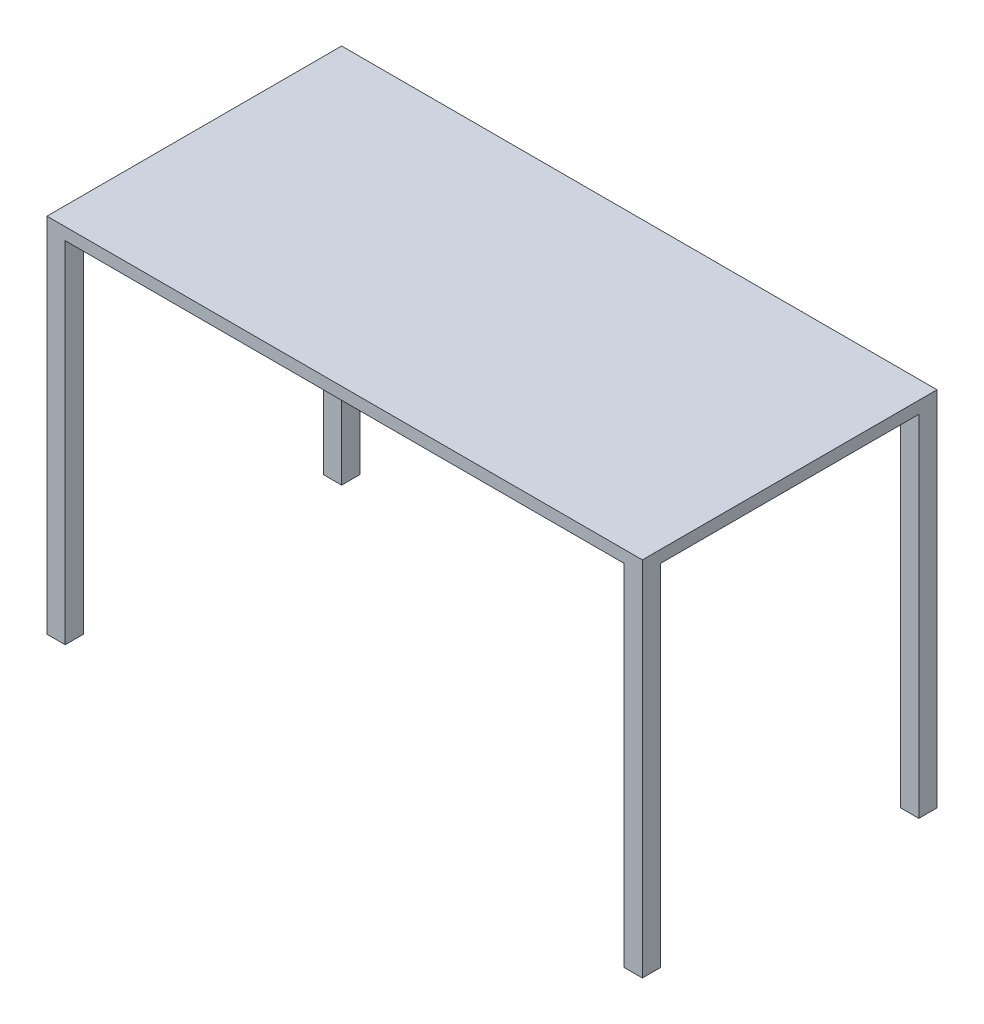
ISO-10303-21;
HEADER;
FILE_DESCRIPTION(('STEP AP214'),'2;1');
FILE_NAME('part.step','',(''),(''),'','','');
FILE_SCHEMA(('AUTOMOTIVE_DESIGN { 1 0 10303 214 1 1 1 1 }'));
ENDSEC;
DATA;
#1=APPLICATION_CONTEXT('core data for automotive mechanical design processes');
#2=APPLICATION_PROTOCOL_DEFINITION('international standard','automotive_design',2000,#1);
#3=PRODUCT_CONTEXT('',#1,'mechanical');
#4=PRODUCT('Part','Part','',(#3));
#5=PRODUCT_RELATED_PRODUCT_CATEGORY('part','',(#4));
#6=PRODUCT_DEFINITION_FORMATION('','',#4);
#7=PRODUCT_DEFINITION_CONTEXT('part definition',#1,'design');
#8=PRODUCT_DEFINITION('design','',#6,#7);
#9=PRODUCT_DEFINITION_SHAPE('','',#8);
#10=(LENGTH_UNIT() NAMED_UNIT(*) SI_UNIT(.MILLI.,.METRE.));
#11=(NAMED_UNIT(*) PLANE_ANGLE_UNIT() SI_UNIT($,.RADIAN.));
#12=(NAMED_UNIT(*) SI_UNIT($,.STERADIAN.) SOLID_ANGLE_UNIT());
#13=UNCERTAINTY_MEASURE_WITH_UNIT(LENGTH_MEASURE(1.E-05),#10,'distance_accuracy_value','');
#14=(GEOMETRIC_REPRESENTATION_CONTEXT(3) GLOBAL_UNCERTAINTY_ASSIGNED_CONTEXT((#13)) GLOBAL_UNIT_ASSIGNED_CONTEXT((#10,
#11,#12)) REPRESENTATION_CONTEXT('',''));
#15=CARTESIAN_POINT('',(0.,0.,0.));
#16=DIRECTION('',(0.,0.,1.));
#17=DIRECTION('',(1.,0.,0.));
#18=AXIS2_PLACEMENT_3D('',#15,#16,#17);
#19=CARTESIAN_POINT('',(0.,0.,0.));
#20=DIRECTION('',(0.,-1.,0.));
#21=DIRECTION('',(0.,0.,-1.));
#22=AXIS2_PLACEMENT_3D('',#19,#20,#21);
#23=PLANE('',#22);
#24=DIRECTION('',(-1.,0.,0.));
#25=VECTOR('',#24,1.);
#26=CARTESIAN_POINT('',(-622.3,0.,-269.875));
#27=LINE('',#26,#25);
#28=CARTESIAN_POINT('',(-584.2,0.,-269.875));
#29=VERTEX_POINT('',#28);
#30=CARTESIAN_POINT('',(-622.3,0.,-269.875));
#31=VERTEX_POINT('',#30);
#32=EDGE_CURVE('E170',#29,#31,#27,.T.);
#33=ORIENTED_EDGE('',*,*,#32,.F.);
#34=DIRECTION('',(0.,0.,1.));
#35=VECTOR('',#34,1.);
#36=CARTESIAN_POINT('',(-584.2,0.,-307.975));
#37=LINE('',#36,#35);
#38=CARTESIAN_POINT('',(-584.2,0.,-307.975));
#39=VERTEX_POINT('',#38);
#40=EDGE_CURVE('E304',#39,#29,#37,.T.);
#41=ORIENTED_EDGE('',*,*,#40,.F.);
#42=DIRECTION('',(-1.,0.,0.));
#43=VECTOR('',#42,1.);
#44=CARTESIAN_POINT('',(-622.3,0.,-307.975));
#45=LINE('',#44,#43);
#46=CARTESIAN_POINT('',(584.2,0.,-307.975));
#47=VERTEX_POINT('',#46);
#48=EDGE_CURVE('E174',#47,#39,#45,.T.);
#49=ORIENTED_EDGE('',*,*,#48,.F.);
#50=DIRECTION('',(0.,0.,-1.));
#51=VECTOR('',#50,1.);
#52=CARTESIAN_POINT('',(584.2,0.,-307.975));
#53=LINE('',#52,#51);
#54=CARTESIAN_POINT('',(584.2,0.,-269.875));
#55=VERTEX_POINT('',#54);
#56=EDGE_CURVE('E177',#55,#47,#53,.T.);
#57=ORIENTED_EDGE('',*,*,#56,.F.);
#58=DIRECTION('',(-1.,0.,0.));
#59=VECTOR('',#58,1.);
#60=CARTESIAN_POINT('',(622.3,0.,-269.875));
#61=LINE('',#60,#59);
#62=CARTESIAN_POINT('',(622.3,0.,-269.875));
#63=VERTEX_POINT('',#62);
#64=EDGE_CURVE('E175',#63,#55,#61,.T.);
#65=ORIENTED_EDGE('',*,*,#64,.F.);
#66=DIRECTION('',(0.,0.,-1.));
#67=VECTOR('',#66,1.);
#68=CARTESIAN_POINT('',(622.3,0.,307.975));
#69=LINE('',#68,#67);
#70=CARTESIAN_POINT('',(622.3,0.,269.875));
#71=VERTEX_POINT('',#70);
#72=EDGE_CURVE('E256',#71,#63,#69,.T.);
#73=ORIENTED_EDGE('',*,*,#72,.F.);
#74=DIRECTION('',(1.,0.,0.));
#75=VECTOR('',#74,1.);
#76=CARTESIAN_POINT('',(622.3,0.,269.875));
#77=LINE('',#76,#75);
#78=CARTESIAN_POINT('',(584.2,0.,269.875));
#79=VERTEX_POINT('',#78);
#80=EDGE_CURVE('E204',#79,#71,#77,.T.);
#81=ORIENTED_EDGE('',*,*,#80,.F.);
#82=DIRECTION('',(0.,0.,-1.));
#83=VECTOR('',#82,1.);
#84=CARTESIAN_POINT('',(584.2,0.,307.975));
#85=LINE('',#84,#83);
#86=CARTESIAN_POINT('',(584.2,0.,307.975));
#87=VERTEX_POINT('',#86);
#88=EDGE_CURVE('E199',#87,#79,#85,.T.);
#89=ORIENTED_EDGE('',*,*,#88,.F.);
#90=DIRECTION('',(1.,0.,0.));
#91=VECTOR('',#90,1.);
#92=CARTESIAN_POINT('',(-622.3,0.,307.975));
#93=LINE('',#92,#91);
#94=CARTESIAN_POINT('',(-584.2,0.,307.975));
#95=VERTEX_POINT('',#94);
#96=EDGE_CURVE('E266',#95,#87,#93,.T.);
#97=ORIENTED_EDGE('',*,*,#96,.F.);
#98=DIRECTION('',(0.,0.,1.));
#99=VECTOR('',#98,1.);
#100=CARTESIAN_POINT('',(-584.2,0.,307.975));
#101=LINE('',#100,#99);
#102=CARTESIAN_POINT('',(-584.2,0.,269.875));
#103=VERTEX_POINT('',#102);
#104=EDGE_CURVE('E226',#103,#95,#101,.T.);
#105=ORIENTED_EDGE('',*,*,#104,.F.);
#106=DIRECTION('',(1.,0.,0.));
#107=VECTOR('',#106,1.);
#108=CARTESIAN_POINT('',(-622.3,0.,269.875));
#109=LINE('',#108,#107);
#110=CARTESIAN_POINT('',(-622.3,0.,269.875));
#111=VERTEX_POINT('',#110);
#112=EDGE_CURVE('E221',#111,#103,#109,.T.);
#113=ORIENTED_EDGE('',*,*,#112,.F.);
#114=DIRECTION('',(0.,0.,1.));
#115=VECTOR('',#114,1.);
#116=CARTESIAN_POINT('',(-622.3,0.,307.975));
#117=LINE('',#116,#115);
#118=EDGE_CURVE('E39',#31,#111,#117,.T.);
#119=ORIENTED_EDGE('',*,*,#118,.F.);
#120=EDGE_LOOP('',(#33,#41,#49,#57,#65,#73,#81,#89,#97,#105,#113,#119));
#121=FACE_BOUND('',#120,.T.);
#122=ADVANCED_FACE('F35',(#121),#23,.T.);
#123=CARTESIAN_POINT('',(622.3,25.4,307.975));
#124=DIRECTION('',(-1.,0.,0.));
#125=DIRECTION('',(0.,0.,1.));
#126=AXIS2_PLACEMENT_3D('',#123,#124,#125);
#127=PLANE('',#126);
#128=DIRECTION('',(0.,-1.,0.));
#129=VECTOR('',#128,1.);
#130=CARTESIAN_POINT('',(622.3,25.4,307.975));
#131=LINE('',#130,#129);
#132=CARTESIAN_POINT('',(622.3,25.4,307.975));
#133=VERTEX_POINT('',#132);
#134=CARTESIAN_POINT('',(622.3,-731.52,307.975));
#135=VERTEX_POINT('',#134);
#136=EDGE_CURVE('E274',#133,#135,#131,.T.);
#137=ORIENTED_EDGE('',*,*,#136,.T.);
#138=DIRECTION('',(0.,0.,1.));
#139=VECTOR('',#138,1.);
#140=CARTESIAN_POINT('',(622.3,-731.52,307.975));
#141=LINE('',#140,#139);
#142=CARTESIAN_POINT('',(622.3,-731.52,269.875));
#143=VERTEX_POINT('',#142);
#144=EDGE_CURVE('E208',#143,#135,#141,.T.);
#145=ORIENTED_EDGE('',*,*,#144,.F.);
#146=DIRECTION('',(0.,1.,0.));
#147=VECTOR('',#146,1.);
#148=CARTESIAN_POINT('',(622.3,-731.52,269.875));
#149=LINE('',#148,#147);
#150=EDGE_CURVE('E211',#143,#71,#149,.T.);
#151=ORIENTED_EDGE('',*,*,#150,.T.);
#152=ORIENTED_EDGE('',*,*,#72,.T.);
#153=DIRECTION('',(0.,1.,0.));
#154=VECTOR('',#153,1.);
#155=CARTESIAN_POINT('',(622.3,-731.52,-269.875));
#156=LINE('',#155,#154);
#157=CARTESIAN_POINT('',(622.3,-731.52,-269.875));
#158=VERTEX_POINT('',#157);
#159=EDGE_CURVE('E197',#158,#63,#156,.T.);
#160=ORIENTED_EDGE('',*,*,#159,.F.);
#161=DIRECTION('',(0.,0.,1.));
#162=VECTOR('',#161,1.);
#163=CARTESIAN_POINT('',(622.3,-731.52,-307.975));
#164=LINE('',#163,#162);
#165=CARTESIAN_POINT('',(622.3,-731.52,-307.975));
#166=VERTEX_POINT('',#165);
#167=EDGE_CURVE('E182',#166,#158,#164,.T.);
#168=ORIENTED_EDGE('',*,*,#167,.F.);
#169=DIRECTION('',(0.,-1.,0.));
#170=VECTOR('',#169,1.);
#171=CARTESIAN_POINT('',(622.3,25.4,-307.975));
#172=LINE('',#171,#170);
#173=CARTESIAN_POINT('',(622.3,25.4,-307.975));
#174=VERTEX_POINT('',#173);
#175=EDGE_CURVE('E11',#174,#166,#172,.T.);
#176=ORIENTED_EDGE('',*,*,#175,.F.);
#177=DIRECTION('',(0.,0.,-1.));
#178=VECTOR('',#177,1.);
#179=CARTESIAN_POINT('',(622.3,25.4,307.975));
#180=LINE('',#179,#178);
#181=EDGE_CURVE('E268',#133,#174,#180,.T.);
#182=ORIENTED_EDGE('',*,*,#181,.F.);
#183=EDGE_LOOP('',(#137,#145,#151,#152,#160,#168,#176,#182));
#184=FACE_BOUND('',#183,.T.);
#185=ADVANCED_FACE('F37',(#184),#127,.F.);
#186=CARTESIAN_POINT('',(-622.3,25.4,-307.975));
#187=DIRECTION('',(0.,0.,1.));
#188=DIRECTION('',(1.,0.,0.));
#189=AXIS2_PLACEMENT_3D('',#186,#187,#188);
#190=PLANE('',#189);
#191=ORIENTED_EDGE('',*,*,#175,.T.);
#192=DIRECTION('',(1.,0.,0.));
#193=VECTOR('',#192,1.);
#194=CARTESIAN_POINT('',(622.3,-731.52,-307.975));
#195=LINE('',#194,#193);
#196=CARTESIAN_POINT('',(584.2,-731.52,-307.975));
#197=VERTEX_POINT('',#196);
#198=EDGE_CURVE('E189',#197,#166,#195,.T.);
#199=ORIENTED_EDGE('',*,*,#198,.F.);
#200=DIRECTION('',(0.,1.,0.));
#201=VECTOR('',#200,1.);
#202=CARTESIAN_POINT('',(584.2,-731.52,-307.975));
#203=LINE('',#202,#201);
#204=EDGE_CURVE('E61',#197,#47,#203,.T.);
#205=ORIENTED_EDGE('',*,*,#204,.T.);
#206=ORIENTED_EDGE('',*,*,#48,.T.);
#207=DIRECTION('',(0.,1.,0.));
#208=VECTOR('',#207,1.);
#209=CARTESIAN_POINT('',(-584.2,-731.52,-307.975));
#210=LINE('',#209,#208);
#211=CARTESIAN_POINT('',(-584.2,-731.52,-307.975));
#212=VERTEX_POINT('',#211);
#213=EDGE_CURVE('E156',#212,#39,#210,.T.);
#214=ORIENTED_EDGE('',*,*,#213,.F.);
#215=DIRECTION('',(1.,0.,0.));
#216=VECTOR('',#215,1.);
#217=CARTESIAN_POINT('',(-622.3,-731.52,-307.975));
#218=LINE('',#217,#216);
#219=CARTESIAN_POINT('',(-622.3,-731.52,-307.975));
#220=VERTEX_POINT('',#219);
#221=EDGE_CURVE('E163',#220,#212,#218,.T.);
#222=ORIENTED_EDGE('',*,*,#221,.F.);
#223=DIRECTION('',(0.,-1.,0.));
#224=VECTOR('',#223,1.);
#225=CARTESIAN_POINT('',(-622.3,25.4,-307.975));
#226=LINE('',#225,#224);
#227=CARTESIAN_POINT('',(-622.3,25.4,-307.975));
#228=VERTEX_POINT('',#227);
#229=EDGE_CURVE('E45',#228,#220,#226,.T.);
#230=ORIENTED_EDGE('',*,*,#229,.F.);
#231=DIRECTION('',(-1.,0.,0.));
#232=VECTOR('',#231,1.);
#233=CARTESIAN_POINT('',(-622.3,25.4,-307.975));
#234=LINE('',#233,#232);
#235=EDGE_CURVE('E282',#174,#228,#234,.T.);
#236=ORIENTED_EDGE('',*,*,#235,.F.);
#237=EDGE_LOOP('',(#191,#199,#205,#206,#214,#222,#230,#236));
#238=FACE_BOUND('',#237,.T.);
#239=ADVANCED_FACE('F172',(#238),#190,.F.);
#240=CARTESIAN_POINT('',(-622.3,25.4,307.975));
#241=DIRECTION('',(1.,0.,0.));
#242=DIRECTION('',(0.,0.,-1.));
#243=AXIS2_PLACEMENT_3D('',#240,#241,#242);
#244=PLANE('',#243);
#245=ORIENTED_EDGE('',*,*,#229,.T.);
#246=DIRECTION('',(0.,0.,-1.));
#247=VECTOR('',#246,1.);
#248=CARTESIAN_POINT('',(-622.3,-731.52,-307.975));
#249=LINE('',#248,#247);
#250=CARTESIAN_POINT('',(-622.3,-731.52,-269.875));
#251=VERTEX_POINT('',#250);
#252=EDGE_CURVE('E168',#251,#220,#249,.T.);
#253=ORIENTED_EDGE('',*,*,#252,.F.);
#254=DIRECTION('',(0.,1.,0.));
#255=VECTOR('',#254,1.);
#256=CARTESIAN_POINT('',(-622.3,-731.52,-269.875));
#257=LINE('',#256,#255);
#258=EDGE_CURVE('E53',#251,#31,#257,.T.);
#259=ORIENTED_EDGE('',*,*,#258,.T.);
#260=ORIENTED_EDGE('',*,*,#118,.T.);
#261=DIRECTION('',(0.,1.,0.));
#262=VECTOR('',#261,1.);
#263=CARTESIAN_POINT('',(-622.3,-731.52,269.875));
#264=LINE('',#263,#262);
#265=CARTESIAN_POINT('',(-622.3,-731.52,269.875));
#266=VERTEX_POINT('',#265);
#267=EDGE_CURVE('E251',#266,#111,#264,.T.);
#268=ORIENTED_EDGE('',*,*,#267,.F.);
#269=DIRECTION('',(0.,0.,-1.));
#270=VECTOR('',#269,1.);
#271=CARTESIAN_POINT('',(-622.3,-731.52,307.975));
#272=LINE('',#271,#270);
#273=CARTESIAN_POINT('',(-622.3,-731.52,307.975));
#274=VERTEX_POINT('',#273);
#275=EDGE_CURVE('E222',#274,#266,#272,.T.);
#276=ORIENTED_EDGE('',*,*,#275,.F.);
#277=DIRECTION('',(0.,-1.,0.));
#278=VECTOR('',#277,1.);
#279=CARTESIAN_POINT('',(-622.3,25.4,307.975));
#280=LINE('',#279,#278);
#281=CARTESIAN_POINT('',(-622.3,25.4,307.975));
#282=VERTEX_POINT('',#281);
#283=EDGE_CURVE('E276',#282,#274,#280,.T.);
#284=ORIENTED_EDGE('',*,*,#283,.F.);
#285=DIRECTION('',(0.,0.,1.));
#286=VECTOR('',#285,1.);
#287=CARTESIAN_POINT('',(-622.3,25.4,307.975));
#288=LINE('',#287,#286);
#289=EDGE_CURVE('E281',#228,#282,#288,.T.);
#290=ORIENTED_EDGE('',*,*,#289,.F.);
#291=EDGE_LOOP('',(#245,#253,#259,#260,#268,#276,#284,#290));
#292=FACE_BOUND('',#291,.T.);
#293=ADVANCED_FACE('F279',(#292),#244,.F.);
#294=CARTESIAN_POINT('',(-622.3,25.4,307.975));
#295=DIRECTION('',(0.,0.,-1.));
#296=DIRECTION('',(-1.,0.,0.));
#297=AXIS2_PLACEMENT_3D('',#294,#295,#296);
#298=PLANE('',#297);
#299=ORIENTED_EDGE('',*,*,#283,.T.);
#300=DIRECTION('',(-1.,0.,0.));
#301=VECTOR('',#300,1.);
#302=CARTESIAN_POINT('',(-622.3,-731.52,307.975));
#303=LINE('',#302,#301);
#304=CARTESIAN_POINT('',(-584.2,-731.52,307.975));
#305=VERTEX_POINT('',#304);
#306=EDGE_CURVE('E230',#305,#274,#303,.T.);
#307=ORIENTED_EDGE('',*,*,#306,.F.);
#308=DIRECTION('',(0.,1.,0.));
#309=VECTOR('',#308,1.);
#310=CARTESIAN_POINT('',(-584.2,-731.52,307.975));
#311=LINE('',#310,#309);
#312=EDGE_CURVE('E233',#305,#95,#311,.T.);
#313=ORIENTED_EDGE('',*,*,#312,.T.);
#314=ORIENTED_EDGE('',*,*,#96,.T.);
#315=DIRECTION('',(0.,1.,0.));
#316=VECTOR('',#315,1.);
#317=CARTESIAN_POINT('',(584.2,-731.52,307.975));
#318=LINE('',#317,#316);
#319=CARTESIAN_POINT('',(584.2,-731.52,307.975));
#320=VERTEX_POINT('',#319);
#321=EDGE_CURVE('E219',#320,#87,#318,.T.);
#322=ORIENTED_EDGE('',*,*,#321,.F.);
#323=DIRECTION('',(-1.,0.,0.));
#324=VECTOR('',#323,1.);
#325=CARTESIAN_POINT('',(622.3,-731.52,307.975));
#326=LINE('',#325,#324);
#327=EDGE_CURVE('E200',#135,#320,#326,.T.);
#328=ORIENTED_EDGE('',*,*,#327,.F.);
#329=ORIENTED_EDGE('',*,*,#136,.F.);
#330=DIRECTION('',(1.,0.,0.));
#331=VECTOR('',#330,1.);
#332=CARTESIAN_POINT('',(-622.3,25.4,307.975));
#333=LINE('',#332,#331);
#334=EDGE_CURVE('E277',#282,#133,#333,.T.);
#335=ORIENTED_EDGE('',*,*,#334,.F.);
#336=EDGE_LOOP('',(#299,#307,#313,#314,#322,#328,#329,#335));
#337=FACE_BOUND('',#336,.T.);
#338=ADVANCED_FACE('F308',(#337),#298,.F.);
#339=CARTESIAN_POINT('',(0.,25.4,0.));
#340=DIRECTION('',(0.,-1.,0.));
#341=DIRECTION('',(0.,0.,-1.));
#342=AXIS2_PLACEMENT_3D('',#339,#340,#341);
#343=PLANE('',#342);
#344=ORIENTED_EDGE('',*,*,#181,.T.);
#345=ORIENTED_EDGE('',*,*,#235,.T.);
#346=ORIENTED_EDGE('',*,*,#289,.T.);
#347=ORIENTED_EDGE('',*,*,#334,.T.);
#348=EDGE_LOOP('',(#344,#345,#346,#347));
#349=FACE_BOUND('',#348,.T.);
#350=ADVANCED_FACE('F288',(#349),#343,.F.);
#351=CARTESIAN_POINT('',(-622.3,-731.52,269.875));
#352=DIRECTION('',(0.,0.,1.));
#353=DIRECTION('',(1.,0.,0.));
#354=AXIS2_PLACEMENT_3D('',#351,#352,#353);
#355=PLANE('',#354);
#356=ORIENTED_EDGE('',*,*,#112,.T.);
#357=DIRECTION('',(0.,1.,0.));
#358=VECTOR('',#357,1.);
#359=CARTESIAN_POINT('',(-584.2,-731.52,269.875));
#360=LINE('',#359,#358);
#361=CARTESIAN_POINT('',(-584.2,-731.52,269.875));
#362=VERTEX_POINT('',#361);
#363=EDGE_CURVE('E236',#362,#103,#360,.T.);
#364=ORIENTED_EDGE('',*,*,#363,.F.);
#365=DIRECTION('',(1.,0.,0.));
#366=VECTOR('',#365,1.);
#367=CARTESIAN_POINT('',(-622.3,-731.52,269.875));
#368=LINE('',#367,#366);
#369=EDGE_CURVE('E225',#266,#362,#368,.T.);
#370=ORIENTED_EDGE('',*,*,#369,.F.);
#371=ORIENTED_EDGE('',*,*,#267,.T.);
#372=EDGE_LOOP('',(#356,#364,#370,#371));
#373=FACE_BOUND('',#372,.T.);
#374=ADVANCED_FACE('F363',(#373),#355,.F.);
#375=CARTESIAN_POINT('',(-584.2,-731.52,307.975));
#376=DIRECTION('',(-1.,0.,0.));
#377=DIRECTION('',(0.,0.,1.));
#378=AXIS2_PLACEMENT_3D('',#375,#376,#377);
#379=PLANE('',#378);
#380=ORIENTED_EDGE('',*,*,#104,.T.);
#381=ORIENTED_EDGE('',*,*,#312,.F.);
#382=DIRECTION('',(0.,0.,1.));
#383=VECTOR('',#382,1.);
#384=CARTESIAN_POINT('',(-584.2,-731.52,307.975));
#385=LINE('',#384,#383);
#386=EDGE_CURVE('E228',#362,#305,#385,.T.);
#387=ORIENTED_EDGE('',*,*,#386,.F.);
#388=ORIENTED_EDGE('',*,*,#363,.T.);
#389=EDGE_LOOP('',(#380,#381,#387,#388));
#390=FACE_BOUND('',#389,.T.);
#391=ADVANCED_FACE('F368',(#390),#379,.F.);
#392=CARTESIAN_POINT('',(0.,-731.52,0.));
#393=DIRECTION('',(0.,-1.,0.));
#394=DIRECTION('',(0.,0.,-1.));
#395=AXIS2_PLACEMENT_3D('',#392,#393,#394);
#396=PLANE('',#395);
#397=ORIENTED_EDGE('',*,*,#275,.T.);
#398=ORIENTED_EDGE('',*,*,#369,.T.);
#399=ORIENTED_EDGE('',*,*,#386,.T.);
#400=ORIENTED_EDGE('',*,*,#306,.T.);
#401=EDGE_LOOP('',(#397,#398,#399,#400));
#402=FACE_BOUND('',#401,.T.);
#403=ADVANCED_FACE('F374',(#402),#396,.T.);
#404=CARTESIAN_POINT('',(584.2,-731.52,307.975));
#405=DIRECTION('',(1.,0.,0.));
#406=DIRECTION('',(0.,0.,-1.));
#407=AXIS2_PLACEMENT_3D('',#404,#405,#406);
#408=PLANE('',#407);
#409=ORIENTED_EDGE('',*,*,#88,.T.);
#410=DIRECTION('',(0.,1.,0.));
#411=VECTOR('',#410,1.);
#412=CARTESIAN_POINT('',(584.2,-731.52,269.875));
#413=LINE('',#412,#411);
#414=CARTESIAN_POINT('',(584.2,-731.52,269.875));
#415=VERTEX_POINT('',#414);
#416=EDGE_CURVE('E216',#415,#79,#413,.T.);
#417=ORIENTED_EDGE('',*,*,#416,.F.);
#418=DIRECTION('',(0.,0.,-1.));
#419=VECTOR('',#418,1.);
#420=CARTESIAN_POINT('',(584.2,-731.52,307.975));
#421=LINE('',#420,#419);
#422=EDGE_CURVE('E203',#320,#415,#421,.T.);
#423=ORIENTED_EDGE('',*,*,#422,.F.);
#424=ORIENTED_EDGE('',*,*,#321,.T.);
#425=EDGE_LOOP('',(#409,#417,#423,#424));
#426=FACE_BOUND('',#425,.T.);
#427=ADVANCED_FACE('F381',(#426),#408,.F.);
#428=CARTESIAN_POINT('',(622.3,-731.52,269.875));
#429=DIRECTION('',(0.,0.,1.));
#430=DIRECTION('',(1.,0.,0.));
#431=AXIS2_PLACEMENT_3D('',#428,#429,#430);
#432=PLANE('',#431);
#433=ORIENTED_EDGE('',*,*,#80,.T.);
#434=ORIENTED_EDGE('',*,*,#150,.F.);
#435=DIRECTION('',(1.,0.,0.));
#436=VECTOR('',#435,1.);
#437=CARTESIAN_POINT('',(622.3,-731.52,269.875));
#438=LINE('',#437,#436);
#439=EDGE_CURVE('E206',#415,#143,#438,.T.);
#440=ORIENTED_EDGE('',*,*,#439,.F.);
#441=ORIENTED_EDGE('',*,*,#416,.T.);
#442=EDGE_LOOP('',(#433,#434,#440,#441));
#443=FACE_BOUND('',#442,.T.);
#444=ADVANCED_FACE('F318',(#443),#432,.F.);
#445=CARTESIAN_POINT('',(0.,-731.52,0.));
#446=DIRECTION('',(0.,-1.,0.));
#447=DIRECTION('',(0.,0.,-1.));
#448=AXIS2_PLACEMENT_3D('',#445,#446,#447);
#449=PLANE('',#448);
#450=ORIENTED_EDGE('',*,*,#327,.T.);
#451=ORIENTED_EDGE('',*,*,#422,.T.);
#452=ORIENTED_EDGE('',*,*,#439,.T.);
#453=ORIENTED_EDGE('',*,*,#144,.T.);
#454=EDGE_LOOP('',(#450,#451,#452,#453));
#455=FACE_BOUND('',#454,.T.);
#456=ADVANCED_FACE('F313',(#455),#449,.T.);
#457=CARTESIAN_POINT('',(622.3,-731.52,-269.875));
#458=DIRECTION('',(0.,0.,-1.));
#459=DIRECTION('',(-1.,0.,0.));
#460=AXIS2_PLACEMENT_3D('',#457,#458,#459);
#461=PLANE('',#460);
#462=ORIENTED_EDGE('',*,*,#64,.T.);
#463=DIRECTION('',(0.,1.,0.));
#464=VECTOR('',#463,1.);
#465=CARTESIAN_POINT('',(584.2,-731.52,-269.875));
#466=LINE('',#465,#464);
#467=CARTESIAN_POINT('',(584.2,-731.52,-269.875));
#468=VERTEX_POINT('',#467);
#469=EDGE_CURVE('E194',#468,#55,#466,.T.);
#470=ORIENTED_EDGE('',*,*,#469,.F.);
#471=DIRECTION('',(-1.,0.,0.));
#472=VECTOR('',#471,1.);
#473=CARTESIAN_POINT('',(622.3,-731.52,-269.875));
#474=LINE('',#473,#472);
#475=EDGE_CURVE('E185',#158,#468,#474,.T.);
#476=ORIENTED_EDGE('',*,*,#475,.F.);
#477=ORIENTED_EDGE('',*,*,#159,.T.);
#478=EDGE_LOOP('',(#462,#470,#476,#477));
#479=FACE_BOUND('',#478,.T.);
#480=ADVANCED_FACE('F323',(#479),#461,.F.);
#481=CARTESIAN_POINT('',(584.2,-731.52,-307.975));
#482=DIRECTION('',(1.,0.,0.));
#483=DIRECTION('',(0.,0.,-1.));
#484=AXIS2_PLACEMENT_3D('',#481,#482,#483);
#485=PLANE('',#484);
#486=ORIENTED_EDGE('',*,*,#56,.T.);
#487=ORIENTED_EDGE('',*,*,#204,.F.);
#488=DIRECTION('',(0.,0.,-1.));
#489=VECTOR('',#488,1.);
#490=CARTESIAN_POINT('',(584.2,-731.52,-307.975));
#491=LINE('',#490,#489);
#492=EDGE_CURVE('E187',#468,#197,#491,.T.);
#493=ORIENTED_EDGE('',*,*,#492,.F.);
#494=ORIENTED_EDGE('',*,*,#469,.T.);
#495=EDGE_LOOP('',(#486,#487,#493,#494));
#496=FACE_BOUND('',#495,.T.);
#497=ADVANCED_FACE('F299',(#496),#485,.F.);
#498=CARTESIAN_POINT('',(0.,-731.52,0.));
#499=DIRECTION('',(0.,-1.,0.));
#500=DIRECTION('',(0.,0.,-1.));
#501=AXIS2_PLACEMENT_3D('',#498,#499,#500);
#502=PLANE('',#501);
#503=ORIENTED_EDGE('',*,*,#167,.T.);
#504=ORIENTED_EDGE('',*,*,#475,.T.);
#505=ORIENTED_EDGE('',*,*,#492,.T.);
#506=ORIENTED_EDGE('',*,*,#198,.T.);
#507=EDGE_LOOP('',(#503,#504,#505,#506));
#508=FACE_BOUND('',#507,.T.);
#509=ADVANCED_FACE('F295',(#508),#502,.T.);
#510=CARTESIAN_POINT('',(-584.2,-731.52,-307.975));
#511=DIRECTION('',(-1.,0.,0.));
#512=DIRECTION('',(0.,0.,1.));
#513=AXIS2_PLACEMENT_3D('',#510,#511,#512);
#514=PLANE('',#513);
#515=ORIENTED_EDGE('',*,*,#40,.T.);
#516=DIRECTION('',(0.,1.,0.));
#517=VECTOR('',#516,1.);
#518=CARTESIAN_POINT('',(-584.2,-731.52,-269.875));
#519=LINE('',#518,#517);
#520=CARTESIAN_POINT('',(-584.2,-731.52,-269.875));
#521=VERTEX_POINT('',#520);
#522=EDGE_CURVE('E159',#521,#29,#519,.T.);
#523=ORIENTED_EDGE('',*,*,#522,.F.);
#524=DIRECTION('',(0.,0.,1.));
#525=VECTOR('',#524,1.);
#526=CARTESIAN_POINT('',(-584.2,-731.52,-307.975));
#527=LINE('',#526,#525);
#528=EDGE_CURVE('E152',#212,#521,#527,.T.);
#529=ORIENTED_EDGE('',*,*,#528,.F.);
#530=ORIENTED_EDGE('',*,*,#213,.T.);
#531=EDGE_LOOP('',(#515,#523,#529,#530));
#532=FACE_BOUND('',#531,.T.);
#533=ADVANCED_FACE('F154',(#532),#514,.F.);
#534=CARTESIAN_POINT('',(-622.3,-731.52,-269.875));
#535=DIRECTION('',(0.,0.,-1.));
#536=DIRECTION('',(-1.,0.,0.));
#537=AXIS2_PLACEMENT_3D('',#534,#535,#536);
#538=PLANE('',#537);
#539=ORIENTED_EDGE('',*,*,#32,.T.);
#540=ORIENTED_EDGE('',*,*,#258,.F.);
#541=DIRECTION('',(-1.,0.,0.));
#542=VECTOR('',#541,1.);
#543=CARTESIAN_POINT('',(-622.3,-731.52,-269.875));
#544=LINE('',#543,#542);
#545=EDGE_CURVE('E162',#521,#251,#544,.T.);
#546=ORIENTED_EDGE('',*,*,#545,.F.);
#547=ORIENTED_EDGE('',*,*,#522,.T.);
#548=EDGE_LOOP('',(#539,#540,#546,#547));
#549=FACE_BOUND('',#548,.T.);
#550=ADVANCED_FACE('F427',(#549),#538,.F.);
#551=CARTESIAN_POINT('',(0.,-731.52,0.));
#552=DIRECTION('',(0.,-1.,0.));
#553=DIRECTION('',(0.,0.,-1.));
#554=AXIS2_PLACEMENT_3D('',#551,#552,#553);
#555=PLANE('',#554);
#556=ORIENTED_EDGE('',*,*,#221,.T.);
#557=ORIENTED_EDGE('',*,*,#528,.T.);
#558=ORIENTED_EDGE('',*,*,#545,.T.);
#559=ORIENTED_EDGE('',*,*,#252,.T.);
#560=EDGE_LOOP('',(#556,#557,#558,#559));
#561=FACE_BOUND('',#560,.T.);
#562=ADVANCED_FACE('F167',(#561),#555,.T.);
#563=CLOSED_SHELL('',(#122,#185,#239,#293,#338,#350,#374,#391,#403,#427,#444,#456,#480,#497,
#509,#533,#550,#562));
#564=MANIFOLD_SOLID_BREP('B2',#563);
#565=ADVANCED_BREP_SHAPE_REPRESENTATION('',(#18,#564),#14);
#566=SHAPE_DEFINITION_REPRESENTATION(#9,#565);
ENDSEC;
END-ISO-10303-21;
